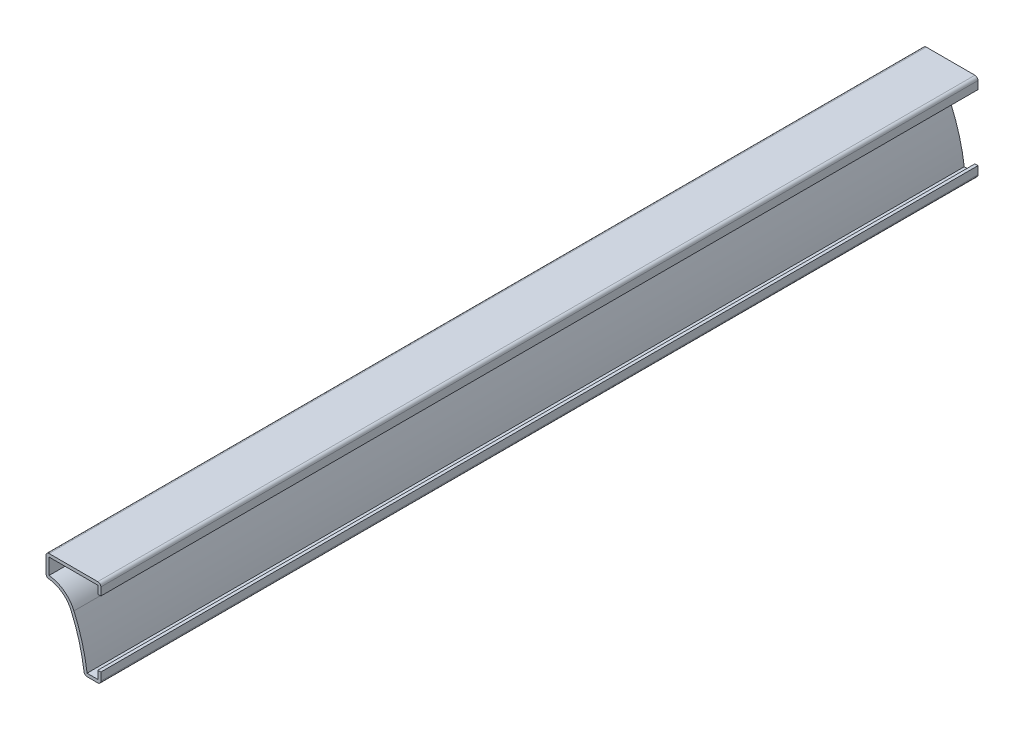
ISO-10303-21;
HEADER;
FILE_DESCRIPTION(('STEP AP214'),'2;1');
FILE_NAME('part.step','',(''),(''),'','','');
FILE_SCHEMA(('AUTOMOTIVE_DESIGN { 1 0 10303 214 1 1 1 1 }'));
ENDSEC;
DATA;
#1=APPLICATION_CONTEXT('core data for automotive mechanical design processes');
#2=APPLICATION_PROTOCOL_DEFINITION('international standard','automotive_design',2000,#1);
#3=PRODUCT_CONTEXT('',#1,'mechanical');
#4=PRODUCT('Part','Part','',(#3));
#5=PRODUCT_RELATED_PRODUCT_CATEGORY('part','',(#4));
#6=PRODUCT_DEFINITION_FORMATION('','',#4);
#7=PRODUCT_DEFINITION_CONTEXT('part definition',#1,'design');
#8=PRODUCT_DEFINITION('design','',#6,#7);
#9=PRODUCT_DEFINITION_SHAPE('','',#8);
#10=(LENGTH_UNIT() NAMED_UNIT(*) SI_UNIT(.MILLI.,.METRE.));
#11=(NAMED_UNIT(*) PLANE_ANGLE_UNIT() SI_UNIT($,.RADIAN.));
#12=(NAMED_UNIT(*) SI_UNIT($,.STERADIAN.) SOLID_ANGLE_UNIT());
#13=UNCERTAINTY_MEASURE_WITH_UNIT(LENGTH_MEASURE(1.E-05),#10,'distance_accuracy_value','');
#14=(GEOMETRIC_REPRESENTATION_CONTEXT(3) GLOBAL_UNCERTAINTY_ASSIGNED_CONTEXT((#13)) GLOBAL_UNIT_ASSIGNED_CONTEXT((#10,
#11,#12)) REPRESENTATION_CONTEXT('',''));
#15=CARTESIAN_POINT('',(0.,0.,0.));
#16=DIRECTION('',(0.,0.,1.));
#17=DIRECTION('',(1.,0.,0.));
#18=AXIS2_PLACEMENT_3D('',#15,#16,#17);
#19=CARTESIAN_POINT('',(-0.889,25.4,-254.));
#20=DIRECTION('',(-1.,0.,0.));
#21=DIRECTION('',(0.,-1.,0.));
#22=AXIS2_PLACEMENT_3D('',#19,#20,#21);
#23=PLANE('',#22);
#24=DIRECTION('',(0.,-1.,0.));
#25=VECTOR('',#24,1.);
#26=CARTESIAN_POINT('',(-0.889,25.4,0.));
#27=LINE('',#26,#25);
#28=CARTESIAN_POINT('',(-0.889,24.511,0.));
#29=VERTEX_POINT('',#28);
#30=CARTESIAN_POINT('',(-0.888999999999999,22.225,0.));
#31=VERTEX_POINT('',#30);
#32=EDGE_CURVE('E244',#29,#31,#27,.T.);
#33=ORIENTED_EDGE('',*,*,#32,.F.);
#34=DIRECTION('',(0.,0.,1.));
#35=VECTOR('',#34,1.);
#36=CARTESIAN_POINT('',(-0.889,24.511,-254.));
#37=LINE('',#36,#35);
#38=CARTESIAN_POINT('',(-0.889,24.511,-254.));
#39=VERTEX_POINT('',#38);
#40=EDGE_CURVE('E203',#39,#29,#37,.T.);
#41=ORIENTED_EDGE('',*,*,#40,.F.);
#42=DIRECTION('',(0.,-1.,0.));
#43=VECTOR('',#42,1.);
#44=CARTESIAN_POINT('',(-0.889,25.4,-254.));
#45=LINE('',#44,#43);
#46=CARTESIAN_POINT('',(-0.888999999999999,22.225,-254.));
#47=VERTEX_POINT('',#46);
#48=EDGE_CURVE('E185',#39,#47,#45,.T.);
#49=ORIENTED_EDGE('',*,*,#48,.T.);
#50=DIRECTION('',(0.,0.,1.));
#51=VECTOR('',#50,1.);
#52=CARTESIAN_POINT('',(-0.888999999999999,22.225,-254.));
#53=LINE('',#52,#51);
#54=EDGE_CURVE('E193',#47,#31,#53,.T.);
#55=ORIENTED_EDGE('',*,*,#54,.T.);
#56=EDGE_LOOP('',(#33,#41,#49,#55));
#57=FACE_BOUND('',#56,.T.);
#58=ADVANCED_FACE('F35',(#57),#23,.T.);
#59=CARTESIAN_POINT('',(-15.875,24.511,-254.));
#60=DIRECTION('',(0.,-1.,0.));
#61=DIRECTION('',(0.,0.,-1.));
#62=AXIS2_PLACEMENT_3D('',#59,#60,#61);
#63=PLANE('',#62);
#64=DIRECTION('',(1.,0.,0.));
#65=VECTOR('',#64,1.);
#66=CARTESIAN_POINT('',(-15.875,24.511,0.));
#67=LINE('',#66,#65);
#68=CARTESIAN_POINT('',(-14.986,24.511,0.));
#69=VERTEX_POINT('',#68);
#70=EDGE_CURVE('E204',#69,#29,#67,.T.);
#71=ORIENTED_EDGE('',*,*,#70,.F.);
#72=DIRECTION('',(0.,0.,1.));
#73=VECTOR('',#72,1.);
#74=CARTESIAN_POINT('',(-14.986,24.511,-254.));
#75=LINE('',#74,#73);
#76=CARTESIAN_POINT('',(-14.986,24.511,-254.));
#77=VERTEX_POINT('',#76);
#78=EDGE_CURVE('E283',#77,#69,#75,.T.);
#79=ORIENTED_EDGE('',*,*,#78,.F.);
#80=DIRECTION('',(1.,0.,0.));
#81=VECTOR('',#80,1.);
#82=CARTESIAN_POINT('',(-15.875,24.511,-254.));
#83=LINE('',#82,#81);
#84=EDGE_CURVE('E201',#77,#39,#83,.T.);
#85=ORIENTED_EDGE('',*,*,#84,.T.);
#86=ORIENTED_EDGE('',*,*,#40,.T.);
#87=EDGE_LOOP('',(#71,#79,#85,#86));
#88=FACE_BOUND('',#87,.T.);
#89=ADVANCED_FACE('F355',(#88),#63,.T.);
#90=CARTESIAN_POINT('',(-14.986,19.05,-254.));
#91=DIRECTION('',(1.,0.,0.));
#92=DIRECTION('',(0.,0.,-1.));
#93=AXIS2_PLACEMENT_3D('',#90,#91,#92);
#94=PLANE('',#93);
#95=DIRECTION('',(0.,1.,0.));
#96=VECTOR('',#95,1.);
#97=CARTESIAN_POINT('',(-14.986,19.05,0.));
#98=LINE('',#97,#96);
#99=CARTESIAN_POINT('',(-14.986,19.8941160955715,0.));
#100=VERTEX_POINT('',#99);
#101=EDGE_CURVE('E207',#100,#69,#98,.T.);
#102=ORIENTED_EDGE('',*,*,#101,.F.);
#103=DIRECTION('',(0.,0.,1.));
#104=VECTOR('',#103,1.);
#105=CARTESIAN_POINT('',(-14.986,19.8941160955715,-254.));
#106=LINE('',#105,#104);
#107=CARTESIAN_POINT('',(-14.986,19.8941160955715,-254.));
#108=VERTEX_POINT('',#107);
#109=EDGE_CURVE('E285',#108,#100,#106,.T.);
#110=ORIENTED_EDGE('',*,*,#109,.F.);
#111=DIRECTION('',(0.,1.,0.));
#112=VECTOR('',#111,1.);
#113=CARTESIAN_POINT('',(-14.986,19.05,-254.));
#114=LINE('',#113,#112);
#115=EDGE_CURVE('E240',#108,#77,#114,.T.);
#116=ORIENTED_EDGE('',*,*,#115,.T.);
#117=ORIENTED_EDGE('',*,*,#78,.T.);
#118=EDGE_LOOP('',(#102,#110,#116,#117));
#119=FACE_BOUND('',#118,.T.);
#120=ADVANCED_FACE('F426',(#119),#94,.T.);
#121=CARTESIAN_POINT('',(-15.875,11.1125,-254.));
#122=DIRECTION('',(0.,0.,1.));
#123=DIRECTION('',(1.,0.,0.));
#124=AXIS2_PLACEMENT_3D('',#121,#122,#123);
#125=CYLINDRICAL_SURFACE('',#124,8.8265);
#126=CARTESIAN_POINT('',(-15.875,11.1125,0.));
#127=DIRECTION('',(0.,0.,1.));
#128=DIRECTION('',(1.,0.,0.));
#129=AXIS2_PLACEMENT_3D('',#126,#127,#128);
#130=CIRCLE('',#129,8.8265);
#131=CARTESIAN_POINT('',(-7.77295371878853,14.6144920484072,0.));
#132=VERTEX_POINT('',#131);
#133=EDGE_CURVE('E276',#132,#100,#130,.T.);
#134=ORIENTED_EDGE('',*,*,#133,.F.);
#135=DIRECTION('',(0.,0.,1.));
#136=VECTOR('',#135,1.);
#137=CARTESIAN_POINT('',(-7.77295371878853,14.6144920484072,-254.));
#138=LINE('',#137,#136);
#139=CARTESIAN_POINT('',(-7.77295371878853,14.6144920484072,-254.));
#140=VERTEX_POINT('',#139);
#141=EDGE_CURVE('E287',#140,#132,#138,.T.);
#142=ORIENTED_EDGE('',*,*,#141,.F.);
#143=CARTESIAN_POINT('',(-15.875,11.1125,-254.));
#144=DIRECTION('',(0.,0.,1.));
#145=DIRECTION('',(1.,0.,0.));
#146=AXIS2_PLACEMENT_3D('',#143,#144,#145);
#147=CIRCLE('',#146,8.8265);
#148=EDGE_CURVE('E237',#140,#108,#147,.T.);
#149=ORIENTED_EDGE('',*,*,#148,.T.);
#150=ORIENTED_EDGE('',*,*,#109,.T.);
#151=EDGE_LOOP('',(#134,#142,#149,#150));
#152=FACE_BOUND('',#151,.T.);
#153=ADVANCED_FACE('F362',(#152),#125,.T.);
#154=CARTESIAN_POINT('',(-55.2194693512068,-5.8935764940639,-254.));
#155=DIRECTION('',(0.,0.,1.));
#156=DIRECTION('',(1.,0.,0.));
#157=AXIS2_PLACEMENT_3D('',#154,#155,#156);
#158=CYLINDRICAL_SURFACE('',#157,51.689);
#159=CARTESIAN_POINT('',(-55.2194693512068,-5.8935764940639,0.));
#160=DIRECTION('',(0.,0.,1.));
#161=DIRECTION('',(1.,0.,0.));
#162=AXIS2_PLACEMENT_3D('',#159,#160,#161);
#163=CIRCLE('',#162,51.689);
#164=CARTESIAN_POINT('',(-3.97740287158308,0.888999999999998,0.));
#165=VERTEX_POINT('',#164);
#166=EDGE_CURVE('E273',#165,#132,#163,.T.);
#167=ORIENTED_EDGE('',*,*,#166,.F.);
#168=DIRECTION('',(0.,0.,1.));
#169=VECTOR('',#168,1.);
#170=CARTESIAN_POINT('',(-3.97740287158308,0.888999999999998,-254.));
#171=LINE('',#170,#169);
#172=CARTESIAN_POINT('',(-3.97740287158308,0.888999999999998,-254.));
#173=VERTEX_POINT('',#172);
#174=EDGE_CURVE('E289',#173,#165,#171,.T.);
#175=ORIENTED_EDGE('',*,*,#174,.F.);
#176=CARTESIAN_POINT('',(-55.2194693512068,-5.8935764940639,-254.));
#177=DIRECTION('',(0.,0.,1.));
#178=DIRECTION('',(1.,0.,0.));
#179=AXIS2_PLACEMENT_3D('',#176,#177,#178);
#180=CIRCLE('',#179,51.689);
#181=EDGE_CURVE('E234',#173,#140,#180,.T.);
#182=ORIENTED_EDGE('',*,*,#181,.T.);
#183=ORIENTED_EDGE('',*,*,#141,.T.);
#184=EDGE_LOOP('',(#167,#175,#182,#183));
#185=FACE_BOUND('',#184,.T.);
#186=ADVANCED_FACE('F365',(#185),#158,.T.);
#187=CARTESIAN_POINT('',(0.,0.889,-254.));
#188=DIRECTION('',(0.,1.,0.));
#189=DIRECTION('',(-1.,0.,0.));
#190=AXIS2_PLACEMENT_3D('',#187,#188,#189);
#191=PLANE('',#190);
#192=DIRECTION('',(-1.,0.,0.));
#193=VECTOR('',#192,1.);
#194=CARTESIAN_POINT('',(0.,0.889,0.));
#195=LINE('',#194,#193);
#196=CARTESIAN_POINT('',(-0.889,0.889,0.));
#197=VERTEX_POINT('',#196);
#198=EDGE_CURVE('E270',#197,#165,#195,.T.);
#199=ORIENTED_EDGE('',*,*,#198,.F.);
#200=DIRECTION('',(0.,0.,1.));
#201=VECTOR('',#200,1.);
#202=CARTESIAN_POINT('',(-0.889,0.889,-254.));
#203=LINE('',#202,#201);
#204=CARTESIAN_POINT('',(-0.889,0.889,-254.));
#205=VERTEX_POINT('',#204);
#206=EDGE_CURVE('E291',#205,#197,#203,.T.);
#207=ORIENTED_EDGE('',*,*,#206,.F.);
#208=DIRECTION('',(-1.,0.,0.));
#209=VECTOR('',#208,1.);
#210=CARTESIAN_POINT('',(0.,0.889,-254.));
#211=LINE('',#210,#209);
#212=EDGE_CURVE('E231',#205,#173,#211,.T.);
#213=ORIENTED_EDGE('',*,*,#212,.T.);
#214=ORIENTED_EDGE('',*,*,#174,.T.);
#215=EDGE_LOOP('',(#199,#207,#213,#214));
#216=FACE_BOUND('',#215,.T.);
#217=ADVANCED_FACE('F370',(#216),#191,.T.);
#218=CARTESIAN_POINT('',(-0.889,3.175,-254.));
#219=DIRECTION('',(-1.,0.,0.));
#220=DIRECTION('',(0.,-1.,0.));
#221=AXIS2_PLACEMENT_3D('',#218,#219,#220);
#222=PLANE('',#221);
#223=DIRECTION('',(0.,-1.,0.));
#224=VECTOR('',#223,1.);
#225=CARTESIAN_POINT('',(-0.889,3.175,0.));
#226=LINE('',#225,#224);
#227=CARTESIAN_POINT('',(-0.889,3.175,0.));
#228=VERTEX_POINT('',#227);
#229=EDGE_CURVE('E267',#228,#197,#226,.T.);
#230=ORIENTED_EDGE('',*,*,#229,.F.);
#231=DIRECTION('',(0.,0.,1.));
#232=VECTOR('',#231,1.);
#233=CARTESIAN_POINT('',(-0.889,3.175,-254.));
#234=LINE('',#233,#232);
#235=CARTESIAN_POINT('',(-0.889,3.175,-254.));
#236=VERTEX_POINT('',#235);
#237=EDGE_CURVE('E293',#236,#228,#234,.T.);
#238=ORIENTED_EDGE('',*,*,#237,.F.);
#239=DIRECTION('',(0.,-1.,0.));
#240=VECTOR('',#239,1.);
#241=CARTESIAN_POINT('',(-0.889,3.175,-254.));
#242=LINE('',#241,#240);
#243=EDGE_CURVE('E228',#236,#205,#242,.T.);
#244=ORIENTED_EDGE('',*,*,#243,.T.);
#245=ORIENTED_EDGE('',*,*,#206,.T.);
#246=EDGE_LOOP('',(#230,#238,#244,#245));
#247=FACE_BOUND('',#246,.T.);
#248=ADVANCED_FACE('F373',(#247),#222,.T.);
#249=CARTESIAN_POINT('',(-0.889,3.175,-254.));
#250=DIRECTION('',(0.,-1.,0.));
#251=DIRECTION('',(0.,0.,-1.));
#252=AXIS2_PLACEMENT_3D('',#249,#250,#251);
#253=PLANE('',#252);
#254=DIRECTION('',(1.,0.,0.));
#255=VECTOR('',#254,1.);
#256=CARTESIAN_POINT('',(-0.889,3.175,0.));
#257=LINE('',#256,#255);
#258=CARTESIAN_POINT('',(0.,3.175,0.));
#259=VERTEX_POINT('',#258);
#260=EDGE_CURVE('E265',#228,#259,#257,.T.);
#261=ORIENTED_EDGE('',*,*,#260,.T.);
#262=DIRECTION('',(0.,0.,1.));
#263=VECTOR('',#262,1.);
#264=CARTESIAN_POINT('',(0.,3.175,-254.));
#265=LINE('',#264,#263);
#266=CARTESIAN_POINT('',(0.,3.175,-254.));
#267=VERTEX_POINT('',#266);
#268=EDGE_CURVE('E295',#267,#259,#265,.T.);
#269=ORIENTED_EDGE('',*,*,#268,.F.);
#270=DIRECTION('',(1.,0.,0.));
#271=VECTOR('',#270,1.);
#272=CARTESIAN_POINT('',(-0.889,3.175,-254.));
#273=LINE('',#272,#271);
#274=EDGE_CURVE('E226',#236,#267,#273,.T.);
#275=ORIENTED_EDGE('',*,*,#274,.F.);
#276=ORIENTED_EDGE('',*,*,#237,.T.);
#277=EDGE_LOOP('',(#261,#269,#275,#276));
#278=FACE_BOUND('',#277,.T.);
#279=ADVANCED_FACE('F379',(#278),#253,.F.);
#280=CARTESIAN_POINT('',(0.,3.175,-254.));
#281=DIRECTION('',(-1.,0.,0.));
#282=DIRECTION('',(0.,-1.,0.));
#283=AXIS2_PLACEMENT_3D('',#280,#281,#282);
#284=PLANE('',#283);
#285=DIRECTION('',(0.,-1.,0.));
#286=VECTOR('',#285,1.);
#287=CARTESIAN_POINT('',(0.,3.175,0.));
#288=LINE('',#287,#286);
#289=CARTESIAN_POINT('',(0.,0.889,0.));
#290=VERTEX_POINT('',#289);
#291=EDGE_CURVE('E262',#259,#290,#288,.T.);
#292=ORIENTED_EDGE('',*,*,#291,.T.);
#293=DIRECTION('',(0.,0.,1.));
#294=VECTOR('',#293,1.);
#295=CARTESIAN_POINT('',(0.,0.889,-254.));
#296=LINE('',#295,#294);
#297=CARTESIAN_POINT('',(0.,0.889,-254.));
#298=VERTEX_POINT('',#297);
#299=EDGE_CURVE('E328',#290,#298,#296,.F.);
#300=ORIENTED_EDGE('',*,*,#299,.T.);
#301=DIRECTION('',(0.,-1.,0.));
#302=VECTOR('',#301,1.);
#303=CARTESIAN_POINT('',(0.,3.175,-254.));
#304=LINE('',#303,#302);
#305=EDGE_CURVE('E223',#267,#298,#304,.T.);
#306=ORIENTED_EDGE('',*,*,#305,.F.);
#307=ORIENTED_EDGE('',*,*,#268,.T.);
#308=EDGE_LOOP('',(#292,#300,#306,#307));
#309=FACE_BOUND('',#308,.T.);
#310=ADVANCED_FACE('F383',(#309),#284,.F.);
#311=CARTESIAN_POINT('',(0.,0.,-254.));
#312=DIRECTION('',(0.,1.,0.));
#313=DIRECTION('',(-1.,0.,0.));
#314=AXIS2_PLACEMENT_3D('',#311,#312,#313);
#315=PLANE('',#314);
#316=DIRECTION('',(-1.,0.,0.));
#317=VECTOR('',#316,1.);
#318=CARTESIAN_POINT('',(0.,0.,0.));
#319=LINE('',#318,#317);
#320=CARTESIAN_POINT('',(-0.889,0.,0.));
#321=VERTEX_POINT('',#320);
#322=CARTESIAN_POINT('',(-3.97740287158307,0.,0.));
#323=VERTEX_POINT('',#322);
#324=EDGE_CURVE('E259',#321,#323,#319,.T.);
#325=ORIENTED_EDGE('',*,*,#324,.T.);
#326=DIRECTION('',(0.,0.,1.));
#327=VECTOR('',#326,1.);
#328=CARTESIAN_POINT('',(-3.97740287158307,0.,-254.));
#329=LINE('',#328,#327);
#330=CARTESIAN_POINT('',(-3.97740287158307,0.,-254.));
#331=VERTEX_POINT('',#330);
#332=EDGE_CURVE('E317',#323,#331,#329,.F.);
#333=ORIENTED_EDGE('',*,*,#332,.T.);
#334=DIRECTION('',(-1.,0.,0.));
#335=VECTOR('',#334,1.);
#336=CARTESIAN_POINT('',(0.,0.,-254.));
#337=LINE('',#336,#335);
#338=CARTESIAN_POINT('',(-0.889,0.,-254.));
#339=VERTEX_POINT('',#338);
#340=EDGE_CURVE('E221',#339,#331,#337,.T.);
#341=ORIENTED_EDGE('',*,*,#340,.F.);
#342=DIRECTION('',(0.,0.,1.));
#343=VECTOR('',#342,1.);
#344=CARTESIAN_POINT('',(-0.889,0.,-254.));
#345=LINE('',#344,#343);
#346=EDGE_CURVE('E314',#339,#321,#345,.T.);
#347=ORIENTED_EDGE('',*,*,#346,.T.);
#348=EDGE_LOOP('',(#325,#333,#341,#347));
#349=FACE_BOUND('',#348,.T.);
#350=ADVANCED_FACE('F391',(#349),#315,.F.);
#351=CARTESIAN_POINT('',(-55.2194693512068,-5.8935764940639,-254.));
#352=DIRECTION('',(0.,0.,1.));
#353=DIRECTION('',(1.,0.,0.));
#354=AXIS2_PLACEMENT_3D('',#351,#352,#353);
#355=CYLINDRICAL_SURFACE('',#354,50.8);
#356=CARTESIAN_POINT('',(-55.2194693512068,-5.8935764940639,-254.));
#357=DIRECTION('',(0.,0.,1.));
#358=DIRECTION('',(1.,0.,0.));
#359=AXIS2_PLACEMENT_3D('',#356,#357,#358);
#360=CIRCLE('',#359,50.8);
#361=CARTESIAN_POINT('',(-4.85871605427931,0.772346350224944,-254.));
#362=VERTEX_POINT('',#361);
#363=CARTESIAN_POINT('',(-8.58898715718394,14.2617734248266,-254.));
#364=VERTEX_POINT('',#363);
#365=EDGE_CURVE('E219',#362,#364,#360,.T.);
#366=ORIENTED_EDGE('',*,*,#365,.F.);
#367=DIRECTION('',(0.,0.,1.));
#368=VECTOR('',#367,1.);
#369=CARTESIAN_POINT('',(-4.85871605427931,0.772346350224944,-254.));
#370=LINE('',#369,#368);
#371=CARTESIAN_POINT('',(-4.85871605427931,0.772346350224944,0.));
#372=VERTEX_POINT('',#371);
#373=EDGE_CURVE('E282',#362,#372,#370,.T.);
#374=ORIENTED_EDGE('',*,*,#373,.T.);
#375=CARTESIAN_POINT('',(-55.2194693512068,-5.8935764940639,0.));
#376=DIRECTION('',(0.,0.,1.));
#377=DIRECTION('',(1.,0.,0.));
#378=AXIS2_PLACEMENT_3D('',#375,#376,#377);
#379=CIRCLE('',#378,50.8);
#380=CARTESIAN_POINT('',(-8.58898715718394,14.2617734248266,0.));
#381=VERTEX_POINT('',#380);
#382=EDGE_CURVE('E257',#372,#381,#379,.T.);
#383=ORIENTED_EDGE('',*,*,#382,.T.);
#384=DIRECTION('',(0.,0.,1.));
#385=VECTOR('',#384,1.);
#386=CARTESIAN_POINT('',(-8.58898715718394,14.2617734248266,-254.));
#387=LINE('',#386,#385);
#388=EDGE_CURVE('E298',#364,#381,#387,.T.);
#389=ORIENTED_EDGE('',*,*,#388,.F.);
#390=EDGE_LOOP('',(#366,#374,#383,#389));
#391=FACE_BOUND('',#390,.T.);
#392=ADVANCED_FACE('F400',(#391),#355,.F.);
#393=CARTESIAN_POINT('',(-15.875,11.1125,-254.));
#394=DIRECTION('',(0.,0.,1.));
#395=DIRECTION('',(1.,0.,0.));
#396=AXIS2_PLACEMENT_3D('',#393,#394,#395);
#397=CYLINDRICAL_SURFACE('',#396,7.9375);
#398=CARTESIAN_POINT('',(-15.875,11.1125,0.));
#399=DIRECTION('',(0.,0.,1.));
#400=DIRECTION('',(1.,0.,0.));
#401=AXIS2_PLACEMENT_3D('',#398,#399,#400);
#402=CIRCLE('',#401,7.9375);
#403=CARTESIAN_POINT('',(-15.0755395683453,19.0096367765931,0.));
#404=VERTEX_POINT('',#403);
#405=EDGE_CURVE('E254',#381,#404,#402,.T.);
#406=ORIENTED_EDGE('',*,*,#405,.T.);
#407=DIRECTION('',(0.,0.,1.));
#408=VECTOR('',#407,1.);
#409=CARTESIAN_POINT('',(-15.0755395683453,19.0096367765931,-254.));
#410=LINE('',#409,#408);
#411=CARTESIAN_POINT('',(-15.0755395683453,19.0096367765931,-254.));
#412=VERTEX_POINT('',#411);
#413=EDGE_CURVE('E335',#404,#412,#410,.F.);
#414=ORIENTED_EDGE('',*,*,#413,.T.);
#415=CARTESIAN_POINT('',(-15.875,11.1125,-254.));
#416=DIRECTION('',(0.,0.,1.));
#417=DIRECTION('',(1.,0.,0.));
#418=AXIS2_PLACEMENT_3D('',#415,#416,#417);
#419=CIRCLE('',#418,7.9375);
#420=EDGE_CURVE('E216',#364,#412,#419,.T.);
#421=ORIENTED_EDGE('',*,*,#420,.F.);
#422=ORIENTED_EDGE('',*,*,#388,.T.);
#423=EDGE_LOOP('',(#406,#414,#421,#422));
#424=FACE_BOUND('',#423,.T.);
#425=ADVANCED_FACE('F404',(#424),#397,.F.);
#426=CARTESIAN_POINT('',(-15.875,19.05,-254.));
#427=DIRECTION('',(1.,0.,0.));
#428=DIRECTION('',(0.,0.,-1.));
#429=AXIS2_PLACEMENT_3D('',#426,#427,#428);
#430=PLANE('',#429);
#431=DIRECTION('',(0.,1.,0.));
#432=VECTOR('',#431,1.);
#433=CARTESIAN_POINT('',(-15.875,19.05,-254.));
#434=LINE('',#433,#432);
#435=CARTESIAN_POINT('',(-15.875,19.8941160955715,-254.));
#436=VERTEX_POINT('',#435);
#437=CARTESIAN_POINT('',(-15.875,24.511,-254.));
#438=VERTEX_POINT('',#437);
#439=EDGE_CURVE('E213',#436,#438,#434,.T.);
#440=ORIENTED_EDGE('',*,*,#439,.F.);
#441=DIRECTION('',(0.,0.,1.));
#442=VECTOR('',#441,1.);
#443=CARTESIAN_POINT('',(-15.875,19.8941160955715,-254.));
#444=LINE('',#443,#442);
#445=CARTESIAN_POINT('',(-15.875,19.8941160955715,0.));
#446=VERTEX_POINT('',#445);
#447=EDGE_CURVE('E332',#436,#446,#444,.T.);
#448=ORIENTED_EDGE('',*,*,#447,.T.);
#449=DIRECTION('',(0.,1.,0.));
#450=VECTOR('',#449,1.);
#451=CARTESIAN_POINT('',(-15.875,19.05,0.));
#452=LINE('',#451,#450);
#453=CARTESIAN_POINT('',(-15.875,24.511,0.));
#454=VERTEX_POINT('',#453);
#455=EDGE_CURVE('E251',#446,#454,#452,.T.);
#456=ORIENTED_EDGE('',*,*,#455,.T.);
#457=DIRECTION('',(0.,0.,1.));
#458=VECTOR('',#457,1.);
#459=CARTESIAN_POINT('',(-15.875,24.511,-254.));
#460=LINE('',#459,#458);
#461=EDGE_CURVE('E330',#454,#438,#460,.F.);
#462=ORIENTED_EDGE('',*,*,#461,.T.);
#463=EDGE_LOOP('',(#440,#448,#456,#462));
#464=FACE_BOUND('',#463,.T.);
#465=ADVANCED_FACE('F412',(#464),#430,.F.);
#466=CARTESIAN_POINT('',(-15.875,25.4,-254.));
#467=DIRECTION('',(0.,-1.,0.));
#468=DIRECTION('',(0.,0.,-1.));
#469=AXIS2_PLACEMENT_3D('',#466,#467,#468);
#470=PLANE('',#469);
#471=DIRECTION('',(1.,0.,0.));
#472=VECTOR('',#471,1.);
#473=CARTESIAN_POINT('',(-15.875,25.4,-254.));
#474=LINE('',#473,#472);
#475=CARTESIAN_POINT('',(-14.986,25.4,-254.));
#476=VERTEX_POINT('',#475);
#477=CARTESIAN_POINT('',(-0.888999999999999,25.4,-254.));
#478=VERTEX_POINT('',#477);
#479=EDGE_CURVE('E211',#476,#478,#474,.T.);
#480=ORIENTED_EDGE('',*,*,#479,.F.);
#481=DIRECTION('',(0.,0.,1.));
#482=VECTOR('',#481,1.);
#483=CARTESIAN_POINT('',(-14.986,25.4,-254.));
#484=LINE('',#483,#482);
#485=CARTESIAN_POINT('',(-14.986,25.4,0.));
#486=VERTEX_POINT('',#485);
#487=EDGE_CURVE('E43',#476,#486,#484,.T.);
#488=ORIENTED_EDGE('',*,*,#487,.T.);
#489=DIRECTION('',(1.,0.,0.));
#490=VECTOR('',#489,1.);
#491=CARTESIAN_POINT('',(-15.875,25.4,0.));
#492=LINE('',#491,#490);
#493=CARTESIAN_POINT('',(-0.888999999999999,25.4,0.));
#494=VERTEX_POINT('',#493);
#495=EDGE_CURVE('E249',#486,#494,#492,.T.);
#496=ORIENTED_EDGE('',*,*,#495,.T.);
#497=DIRECTION('',(0.,0.,1.));
#498=VECTOR('',#497,1.);
#499=CARTESIAN_POINT('',(-0.888999999999999,25.4,-254.));
#500=LINE('',#499,#498);
#501=EDGE_CURVE('E58',#494,#478,#500,.F.);
#502=ORIENTED_EDGE('',*,*,#501,.T.);
#503=EDGE_LOOP('',(#480,#488,#496,#502));
#504=FACE_BOUND('',#503,.T.);
#505=ADVANCED_FACE('F340',(#504),#470,.F.);
#506=CARTESIAN_POINT('',(0.,25.4,-254.));
#507=DIRECTION('',(-1.,0.,0.));
#508=DIRECTION('',(0.,-1.,0.));
#509=AXIS2_PLACEMENT_3D('',#506,#507,#508);
#510=PLANE('',#509);
#511=DIRECTION('',(0.,-1.,0.));
#512=VECTOR('',#511,1.);
#513=CARTESIAN_POINT('',(0.,25.4,-254.));
#514=LINE('',#513,#512);
#515=CARTESIAN_POINT('',(0.,24.511,-254.));
#516=VERTEX_POINT('',#515);
#517=CARTESIAN_POINT('',(0.,22.225,-254.));
#518=VERTEX_POINT('',#517);
#519=EDGE_CURVE('E187',#516,#518,#514,.T.);
#520=ORIENTED_EDGE('',*,*,#519,.F.);
#521=DIRECTION('',(0.,0.,1.));
#522=VECTOR('',#521,1.);
#523=CARTESIAN_POINT('',(0.,24.511,-254.));
#524=LINE('',#523,#522);
#525=CARTESIAN_POINT('',(0.,24.511,0.));
#526=VERTEX_POINT('',#525);
#527=EDGE_CURVE('E11',#516,#526,#524,.T.);
#528=ORIENTED_EDGE('',*,*,#527,.T.);
#529=DIRECTION('',(0.,-1.,0.));
#530=VECTOR('',#529,1.);
#531=CARTESIAN_POINT('',(0.,25.4,0.));
#532=LINE('',#531,#530);
#533=CARTESIAN_POINT('',(0.,22.225,0.));
#534=VERTEX_POINT('',#533);
#535=EDGE_CURVE('E247',#526,#534,#532,.T.);
#536=ORIENTED_EDGE('',*,*,#535,.T.);
#537=DIRECTION('',(0.,0.,1.));
#538=VECTOR('',#537,1.);
#539=CARTESIAN_POINT('',(0.,22.225,-254.));
#540=LINE('',#539,#538);
#541=EDGE_CURVE('E200',#518,#534,#540,.T.);
#542=ORIENTED_EDGE('',*,*,#541,.F.);
#543=EDGE_LOOP('',(#520,#528,#536,#542));
#544=FACE_BOUND('',#543,.T.);
#545=ADVANCED_FACE('F351',(#544),#510,.F.);
#546=CARTESIAN_POINT('',(0.,22.225,-254.));
#547=DIRECTION('',(0.,1.,0.));
#548=DIRECTION('',(0.,0.,1.));
#549=AXIS2_PLACEMENT_3D('',#546,#547,#548);
#550=PLANE('',#549);
#551=DIRECTION('',(-1.,0.,0.));
#552=VECTOR('',#551,1.);
#553=CARTESIAN_POINT('',(0.,22.225,0.));
#554=LINE('',#553,#552);
#555=EDGE_CURVE('E196',#534,#31,#554,.T.);
#556=ORIENTED_EDGE('',*,*,#555,.T.);
#557=ORIENTED_EDGE('',*,*,#54,.F.);
#558=DIRECTION('',(-1.,0.,0.));
#559=VECTOR('',#558,1.);
#560=CARTESIAN_POINT('',(0.,22.225,-254.));
#561=LINE('',#560,#559);
#562=EDGE_CURVE('E179',#518,#47,#561,.T.);
#563=ORIENTED_EDGE('',*,*,#562,.F.);
#564=ORIENTED_EDGE('',*,*,#541,.T.);
#565=EDGE_LOOP('',(#556,#557,#563,#564));
#566=FACE_BOUND('',#565,.T.);
#567=ADVANCED_FACE('F194',(#566),#550,.F.);
#568=CARTESIAN_POINT('',(-15.875,11.1125,-254.));
#569=DIRECTION('',(0.,0.,1.));
#570=DIRECTION('',(1.,0.,0.));
#571=AXIS2_PLACEMENT_3D('',#568,#569,#570);
#572=PLANE('',#571);
#573=ORIENTED_EDGE('',*,*,#340,.T.);
#574=CARTESIAN_POINT('',(-3.97740287158307,0.888999999999999,-254.));
#575=DIRECTION('',(0.,0.,1.));
#576=DIRECTION('',(1.,0.,0.));
#577=AXIS2_PLACEMENT_3D('',#574,#575,#576);
#578=CIRCLE('',#577,0.889);
#579=EDGE_CURVE('E326',#331,#362,#578,.F.);
#580=ORIENTED_EDGE('',*,*,#579,.T.);
#581=ORIENTED_EDGE('',*,*,#365,.T.);
#582=ORIENTED_EDGE('',*,*,#420,.T.);
#583=CARTESIAN_POINT('',(-14.986,19.8941160955715,-254.));
#584=DIRECTION('',(0.,0.,1.));
#585=DIRECTION('',(1.,0.,0.));
#586=AXIS2_PLACEMENT_3D('',#583,#584,#585);
#587=CIRCLE('',#586,0.889);
#588=EDGE_CURVE('E322',#412,#436,#587,.F.);
#589=ORIENTED_EDGE('',*,*,#588,.T.);
#590=ORIENTED_EDGE('',*,*,#439,.T.);
#591=CARTESIAN_POINT('',(-14.986,24.511,-254.));
#592=DIRECTION('',(0.,0.,1.));
#593=DIRECTION('',(1.,0.,0.));
#594=AXIS2_PLACEMENT_3D('',#591,#592,#593);
#595=CIRCLE('',#594,0.889);
#596=EDGE_CURVE('E320',#438,#476,#595,.F.);
#597=ORIENTED_EDGE('',*,*,#596,.T.);
#598=ORIENTED_EDGE('',*,*,#479,.T.);
#599=CARTESIAN_POINT('',(-0.889,24.511,-254.));
#600=DIRECTION('',(0.,0.,1.));
#601=DIRECTION('',(1.,0.,0.));
#602=AXIS2_PLACEMENT_3D('',#599,#600,#601);
#603=CIRCLE('',#602,0.889);
#604=EDGE_CURVE('E50',#478,#516,#603,.F.);
#605=ORIENTED_EDGE('',*,*,#604,.T.);
#606=ORIENTED_EDGE('',*,*,#519,.T.);
#607=ORIENTED_EDGE('',*,*,#562,.T.);
#608=ORIENTED_EDGE('',*,*,#48,.F.);
#609=ORIENTED_EDGE('',*,*,#84,.F.);
#610=ORIENTED_EDGE('',*,*,#115,.F.);
#611=ORIENTED_EDGE('',*,*,#148,.F.);
#612=ORIENTED_EDGE('',*,*,#181,.F.);
#613=ORIENTED_EDGE('',*,*,#212,.F.);
#614=ORIENTED_EDGE('',*,*,#243,.F.);
#615=ORIENTED_EDGE('',*,*,#274,.T.);
#616=ORIENTED_EDGE('',*,*,#305,.T.);
#617=CARTESIAN_POINT('',(-0.889,0.889,-254.));
#618=DIRECTION('',(0.,0.,1.));
#619=DIRECTION('',(1.,0.,0.));
#620=AXIS2_PLACEMENT_3D('',#617,#618,#619);
#621=CIRCLE('',#620,0.889);
#622=EDGE_CURVE('E324',#298,#339,#621,.F.);
#623=ORIENTED_EDGE('',*,*,#622,.T.);
#624=EDGE_LOOP('',(#573,#580,#581,#582,#589,#590,#597,#598,#605,#606,#607,#608,#609,#610,#611,
#612,#613,#614,#615,#616,#623));
#625=FACE_BOUND('',#624,.T.);
#626=ADVANCED_FACE('F182',(#625),#572,.F.);
#627=CARTESIAN_POINT('',(-15.875,11.1125,0.));
#628=DIRECTION('',(0.,0.,1.));
#629=DIRECTION('',(1.,0.,0.));
#630=AXIS2_PLACEMENT_3D('',#627,#628,#629);
#631=PLANE('',#630);
#632=ORIENTED_EDGE('',*,*,#382,.F.);
#633=CARTESIAN_POINT('',(-3.97740287158307,0.888999999999999,0.));
#634=DIRECTION('',(0.,0.,1.));
#635=DIRECTION('',(1.,0.,0.));
#636=AXIS2_PLACEMENT_3D('',#633,#634,#635);
#637=CIRCLE('',#636,0.889);
#638=EDGE_CURVE('E312',#372,#323,#637,.T.);
#639=ORIENTED_EDGE('',*,*,#638,.T.);
#640=ORIENTED_EDGE('',*,*,#324,.F.);
#641=CARTESIAN_POINT('',(-0.889,0.889,0.));
#642=DIRECTION('',(0.,0.,1.));
#643=DIRECTION('',(1.,0.,0.));
#644=AXIS2_PLACEMENT_3D('',#641,#642,#643);
#645=CIRCLE('',#644,0.889);
#646=EDGE_CURVE('E310',#321,#290,#645,.T.);
#647=ORIENTED_EDGE('',*,*,#646,.T.);
#648=ORIENTED_EDGE('',*,*,#291,.F.);
#649=ORIENTED_EDGE('',*,*,#260,.F.);
#650=ORIENTED_EDGE('',*,*,#229,.T.);
#651=ORIENTED_EDGE('',*,*,#198,.T.);
#652=ORIENTED_EDGE('',*,*,#166,.T.);
#653=ORIENTED_EDGE('',*,*,#133,.T.);
#654=ORIENTED_EDGE('',*,*,#101,.T.);
#655=ORIENTED_EDGE('',*,*,#70,.T.);
#656=ORIENTED_EDGE('',*,*,#32,.T.);
#657=ORIENTED_EDGE('',*,*,#555,.F.);
#658=ORIENTED_EDGE('',*,*,#535,.F.);
#659=CARTESIAN_POINT('',(-0.889,24.511,0.));
#660=DIRECTION('',(0.,0.,1.));
#661=DIRECTION('',(1.,0.,0.));
#662=AXIS2_PLACEMENT_3D('',#659,#660,#661);
#663=CIRCLE('',#662,0.889);
#664=EDGE_CURVE('E304',#526,#494,#663,.T.);
#665=ORIENTED_EDGE('',*,*,#664,.T.);
#666=ORIENTED_EDGE('',*,*,#495,.F.);
#667=CARTESIAN_POINT('',(-14.986,24.511,0.));
#668=DIRECTION('',(0.,0.,1.));
#669=DIRECTION('',(1.,0.,0.));
#670=AXIS2_PLACEMENT_3D('',#667,#668,#669);
#671=CIRCLE('',#670,0.889);
#672=EDGE_CURVE('E306',#486,#454,#671,.T.);
#673=ORIENTED_EDGE('',*,*,#672,.T.);
#674=ORIENTED_EDGE('',*,*,#455,.F.);
#675=CARTESIAN_POINT('',(-14.986,19.8941160955715,0.));
#676=DIRECTION('',(0.,0.,1.));
#677=DIRECTION('',(1.,0.,0.));
#678=AXIS2_PLACEMENT_3D('',#675,#676,#677);
#679=CIRCLE('',#678,0.889);
#680=EDGE_CURVE('E308',#446,#404,#679,.T.);
#681=ORIENTED_EDGE('',*,*,#680,.T.);
#682=ORIENTED_EDGE('',*,*,#405,.F.);
#683=EDGE_LOOP('',(#632,#639,#640,#647,#648,#649,#650,#651,#652,#653,#654,#655,#656,#657,#658,
#665,#666,#673,#674,#681,#682));
#684=FACE_BOUND('',#683,.T.);
#685=ADVANCED_FACE('F345',(#684),#631,.T.);
#686=CARTESIAN_POINT('',(-3.97740287158307,0.888999999999999,-254.));
#687=DIRECTION('',(0.,0.,1.));
#688=DIRECTION('',(1.,0.,0.));
#689=AXIS2_PLACEMENT_3D('',#686,#687,#688);
#690=CYLINDRICAL_SURFACE('',#689,0.889);
#691=ORIENTED_EDGE('',*,*,#579,.F.);
#692=ORIENTED_EDGE('',*,*,#332,.F.);
#693=ORIENTED_EDGE('',*,*,#638,.F.);
#694=ORIENTED_EDGE('',*,*,#373,.F.);
#695=EDGE_LOOP('',(#691,#692,#693,#694));
#696=FACE_BOUND('',#695,.T.);
#697=ADVANCED_FACE('F395',(#696),#690,.T.);
#698=CARTESIAN_POINT('',(-0.889,0.889,-254.));
#699=DIRECTION('',(0.,0.,1.));
#700=DIRECTION('',(1.,0.,0.));
#701=AXIS2_PLACEMENT_3D('',#698,#699,#700);
#702=CYLINDRICAL_SURFACE('',#701,0.889);
#703=ORIENTED_EDGE('',*,*,#622,.F.);
#704=ORIENTED_EDGE('',*,*,#299,.F.);
#705=ORIENTED_EDGE('',*,*,#646,.F.);
#706=ORIENTED_EDGE('',*,*,#346,.F.);
#707=EDGE_LOOP('',(#703,#704,#705,#706));
#708=FACE_BOUND('',#707,.T.);
#709=ADVANCED_FACE('F386',(#708),#702,.T.);
#710=CARTESIAN_POINT('',(-14.986,19.8941160955715,-254.));
#711=DIRECTION('',(0.,0.,1.));
#712=DIRECTION('',(1.,0.,0.));
#713=AXIS2_PLACEMENT_3D('',#710,#711,#712);
#714=CYLINDRICAL_SURFACE('',#713,0.889);
#715=ORIENTED_EDGE('',*,*,#588,.F.);
#716=ORIENTED_EDGE('',*,*,#413,.F.);
#717=ORIENTED_EDGE('',*,*,#680,.F.);
#718=ORIENTED_EDGE('',*,*,#447,.F.);
#719=EDGE_LOOP('',(#715,#716,#717,#718));
#720=FACE_BOUND('',#719,.T.);
#721=ADVANCED_FACE('F410',(#720),#714,.T.);
#722=CARTESIAN_POINT('',(-14.986,24.511,-254.));
#723=DIRECTION('',(0.,0.,1.));
#724=DIRECTION('',(1.,0.,0.));
#725=AXIS2_PLACEMENT_3D('',#722,#723,#724);
#726=CYLINDRICAL_SURFACE('',#725,0.889);
#727=ORIENTED_EDGE('',*,*,#596,.F.);
#728=ORIENTED_EDGE('',*,*,#461,.F.);
#729=ORIENTED_EDGE('',*,*,#672,.F.);
#730=ORIENTED_EDGE('',*,*,#487,.F.);
#731=EDGE_LOOP('',(#727,#728,#729,#730));
#732=FACE_BOUND('',#731,.T.);
#733=ADVANCED_FACE('F414',(#732),#726,.T.);
#734=CARTESIAN_POINT('',(-0.889,24.511,-254.));
#735=DIRECTION('',(0.,0.,1.));
#736=DIRECTION('',(1.,0.,0.));
#737=AXIS2_PLACEMENT_3D('',#734,#735,#736);
#738=CYLINDRICAL_SURFACE('',#737,0.889);
#739=ORIENTED_EDGE('',*,*,#604,.F.);
#740=ORIENTED_EDGE('',*,*,#501,.F.);
#741=ORIENTED_EDGE('',*,*,#664,.F.);
#742=ORIENTED_EDGE('',*,*,#527,.F.);
#743=EDGE_LOOP('',(#739,#740,#741,#742));
#744=FACE_BOUND('',#743,.T.);
#745=ADVANCED_FACE('F37',(#744),#738,.T.);
#746=CLOSED_SHELL('',(#58,#89,#120,#153,#186,#217,#248,#279,#310,#350,#392,#425,#465,#505,#545,
#567,#626,#685,#697,#709,#721,#733,#745));
#747=MANIFOLD_SOLID_BREP('B2',#746);
#748=ADVANCED_BREP_SHAPE_REPRESENTATION('',(#18,#747),#14);
#749=SHAPE_DEFINITION_REPRESENTATION(#9,#748);
ENDSEC;
END-ISO-10303-21;
